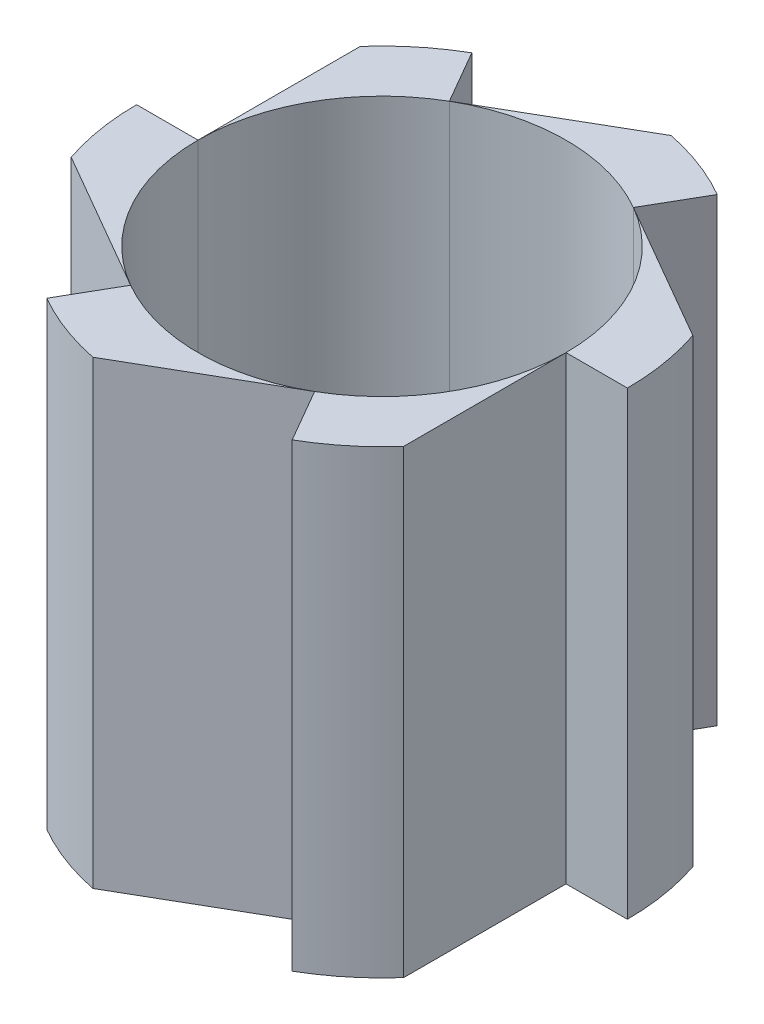
ISO-10303-21;
HEADER;
FILE_DESCRIPTION(('STEP AP214'),'2;1');
FILE_NAME('part.step','',(''),(''),'','','');
FILE_SCHEMA(('AUTOMOTIVE_DESIGN { 1 0 10303 214 1 1 1 1 }'));
ENDSEC;
DATA;
#1=APPLICATION_CONTEXT('core data for automotive mechanical design processes');
#2=APPLICATION_PROTOCOL_DEFINITION('international standard','automotive_design',2000,#1);
#3=PRODUCT_CONTEXT('',#1,'mechanical');
#4=PRODUCT('Part','Part','',(#3));
#5=PRODUCT_RELATED_PRODUCT_CATEGORY('part','',(#4));
#6=PRODUCT_DEFINITION_FORMATION('','',#4);
#7=PRODUCT_DEFINITION_CONTEXT('part definition',#1,'design');
#8=PRODUCT_DEFINITION('design','',#6,#7);
#9=PRODUCT_DEFINITION_SHAPE('','',#8);
#10=(LENGTH_UNIT() NAMED_UNIT(*) SI_UNIT(.MILLI.,.METRE.));
#11=(NAMED_UNIT(*) PLANE_ANGLE_UNIT() SI_UNIT($,.RADIAN.));
#12=(NAMED_UNIT(*) SI_UNIT($,.STERADIAN.) SOLID_ANGLE_UNIT());
#13=UNCERTAINTY_MEASURE_WITH_UNIT(LENGTH_MEASURE(1.E-05),#10,'distance_accuracy_value','');
#14=(GEOMETRIC_REPRESENTATION_CONTEXT(3) GLOBAL_UNCERTAINTY_ASSIGNED_CONTEXT((#13)) GLOBAL_UNIT_ASSIGNED_CONTEXT((#10,
#11,#12)) REPRESENTATION_CONTEXT('',''));
#15=CARTESIAN_POINT('',(0.,0.,0.));
#16=DIRECTION('',(0.,0.,1.));
#17=DIRECTION('',(1.,0.,0.));
#18=AXIS2_PLACEMENT_3D('',#15,#16,#17);
#19=CARTESIAN_POINT('',(0.,45.,0.));
#20=DIRECTION('',(0.,0.,1.));
#21=DIRECTION('',(1.,0.,0.));
#22=AXIS2_PLACEMENT_3D('',#19,#20,#21);
#23=PLANE('',#22);
#24=DIRECTION('',(-1.,0.,0.));
#25=VECTOR('',#24,1.);
#26=CARTESIAN_POINT('',(0.,0.,0.));
#27=LINE('',#26,#25);
#28=CARTESIAN_POINT('',(-18.,0.,0.));
#29=VERTEX_POINT('',#28);
#30=CARTESIAN_POINT('',(-24.,0.,0.));
#31=VERTEX_POINT('',#30);
#32=EDGE_CURVE('E206',#29,#31,#27,.T.);
#33=ORIENTED_EDGE('',*,*,#32,.T.);
#34=DIRECTION('',(0.,-1.,0.));
#35=VECTOR('',#34,1.);
#36=CARTESIAN_POINT('',(-24.,45.,0.));
#37=LINE('',#36,#35);
#38=CARTESIAN_POINT('',(-24.,45.,0.));
#39=VERTEX_POINT('',#38);
#40=EDGE_CURVE('E13',#39,#31,#37,.T.);
#41=ORIENTED_EDGE('',*,*,#40,.F.);
#42=DIRECTION('',(-1.,0.,0.));
#43=VECTOR('',#42,1.);
#44=CARTESIAN_POINT('',(0.,45.,0.));
#45=LINE('',#44,#43);
#46=CARTESIAN_POINT('',(-18.,45.,0.));
#47=VERTEX_POINT('',#46);
#48=EDGE_CURVE('E192',#47,#39,#45,.T.);
#49=ORIENTED_EDGE('',*,*,#48,.F.);
#50=DIRECTION('',(0.,-1.,0.));
#51=VECTOR('',#50,1.);
#52=CARTESIAN_POINT('',(-18.,45.,0.));
#53=LINE('',#52,#51);
#54=EDGE_CURVE('E159',#47,#29,#53,.T.);
#55=ORIENTED_EDGE('',*,*,#54,.T.);
#56=EDGE_LOOP('',(#33,#41,#49,#55));
#57=FACE_BOUND('',#56,.T.);
#58=ADVANCED_FACE('F143',(#57),#23,.F.);
#59=CARTESIAN_POINT('',(0.,45.,0.));
#60=DIRECTION('',(0.,-1.,0.));
#61=DIRECTION('',(0.,0.,-1.));
#62=AXIS2_PLACEMENT_3D('',#59,#60,#61);
#63=CYLINDRICAL_SURFACE('',#62,24.);
#64=CARTESIAN_POINT('',(0.,0.,0.));
#65=DIRECTION('',(0.,1.,0.));
#66=DIRECTION('',(0.,0.,1.));
#67=AXIS2_PLACEMENT_3D('',#64,#65,#66);
#68=CIRCLE('',#67,24.);
#69=CARTESIAN_POINT('',(-22.7477270848675,0.,7.65120333492611));
#70=VERTEX_POINT('',#69);
#71=EDGE_CURVE('E197',#31,#70,#68,.T.);
#72=ORIENTED_EDGE('',*,*,#71,.T.);
#73=DIRECTION('',(0.,-1.,0.));
#74=VECTOR('',#73,1.);
#75=CARTESIAN_POINT('',(-22.7477270848675,45.,7.65120333492611));
#76=LINE('',#75,#74);
#77=CARTESIAN_POINT('',(-22.7477270848675,45.,7.65120333492611));
#78=VERTEX_POINT('',#77);
#79=EDGE_CURVE('E151',#78,#70,#76,.T.);
#80=ORIENTED_EDGE('',*,*,#79,.F.);
#81=CARTESIAN_POINT('',(0.,45.,0.));
#82=DIRECTION('',(0.,1.,0.));
#83=DIRECTION('',(0.,0.,1.));
#84=AXIS2_PLACEMENT_3D('',#81,#82,#83);
#85=CIRCLE('',#84,24.);
#86=EDGE_CURVE('E184',#39,#78,#85,.T.);
#87=ORIENTED_EDGE('',*,*,#86,.F.);
#88=ORIENTED_EDGE('',*,*,#40,.T.);
#89=EDGE_LOOP('',(#72,#80,#87,#88));
#90=FACE_BOUND('',#89,.T.);
#91=ADVANCED_FACE('F196',(#90),#63,.T.);
#92=CARTESIAN_POINT('',(-9.,45.,15.5884572681199));
#93=DIRECTION('',(-0.5,0.,0.866025403784438));
#94=DIRECTION('',(0.866025403784439,0.,0.5));
#95=AXIS2_PLACEMENT_3D('',#92,#93,#94);
#96=PLANE('',#95);
#97=DIRECTION('',(-0.866025403784439,0.,-0.5));
#98=VECTOR('',#97,1.);
#99=CARTESIAN_POINT('',(-9.,0.,15.5884572681199));
#100=LINE('',#99,#98);
#101=CARTESIAN_POINT('',(-9.00000000000017,0.,15.5884572681199));
#102=VERTEX_POINT('',#101);
#103=EDGE_CURVE('E209',#102,#70,#100,.T.);
#104=ORIENTED_EDGE('',*,*,#103,.F.);
#105=DIRECTION('',(0.,-1.,0.));
#106=VECTOR('',#105,1.);
#107=CARTESIAN_POINT('',(-9.00000000000017,45.,15.5884572681199));
#108=LINE('',#107,#106);
#109=CARTESIAN_POINT('',(-9.00000000000017,45.,15.5884572681199));
#110=VERTEX_POINT('',#109);
#111=EDGE_CURVE('E173',#110,#102,#108,.T.);
#112=ORIENTED_EDGE('',*,*,#111,.F.);
#113=DIRECTION('',(-0.866025403784439,0.,-0.5));
#114=VECTOR('',#113,1.);
#115=CARTESIAN_POINT('',(-9.,45.,15.5884572681199));
#116=LINE('',#115,#114);
#117=EDGE_CURVE('E191',#110,#78,#116,.T.);
#118=ORIENTED_EDGE('',*,*,#117,.T.);
#119=ORIENTED_EDGE('',*,*,#79,.T.);
#120=EDGE_LOOP('',(#104,#112,#118,#119));
#121=FACE_BOUND('',#120,.T.);
#122=ADVANCED_FACE('F200',(#121),#96,.T.);
#123=CARTESIAN_POINT('',(0.,45.,0.));
#124=DIRECTION('',(0.,-1.,0.));
#125=DIRECTION('',(0.,0.,-1.));
#126=AXIS2_PLACEMENT_3D('',#123,#124,#125);
#127=CYLINDRICAL_SURFACE('',#126,18.);
#128=CARTESIAN_POINT('',(0.,0.,0.));
#129=DIRECTION('',(0.,1.,0.));
#130=DIRECTION('',(0.,0.,1.));
#131=AXIS2_PLACEMENT_3D('',#128,#129,#130);
#132=CIRCLE('',#131,18.);
#133=EDGE_CURVE('E211',#29,#102,#132,.T.);
#134=ORIENTED_EDGE('',*,*,#133,.F.);
#135=ORIENTED_EDGE('',*,*,#54,.F.);
#136=CARTESIAN_POINT('',(0.,45.,0.));
#137=DIRECTION('',(0.,1.,0.));
#138=DIRECTION('',(0.,0.,1.));
#139=AXIS2_PLACEMENT_3D('',#136,#137,#138);
#140=CIRCLE('',#139,18.);
#141=EDGE_CURVE('E201',#47,#110,#140,.T.);
#142=ORIENTED_EDGE('',*,*,#141,.T.);
#143=ORIENTED_EDGE('',*,*,#111,.T.);
#144=EDGE_LOOP('',(#134,#135,#142,#143));
#145=FACE_BOUND('',#144,.T.);
#146=ADVANCED_FACE('F217',(#145),#127,.F.);
#147=CARTESIAN_POINT('',(0.,45.,0.));
#148=DIRECTION('',(0.,1.,0.));
#149=DIRECTION('',(0.,0.,1.));
#150=AXIS2_PLACEMENT_3D('',#147,#148,#149);
#151=PLANE('',#150);
#152=ORIENTED_EDGE('',*,*,#48,.T.);
#153=ORIENTED_EDGE('',*,*,#86,.T.);
#154=ORIENTED_EDGE('',*,*,#117,.F.);
#155=ORIENTED_EDGE('',*,*,#141,.F.);
#156=EDGE_LOOP('',(#152,#153,#154,#155));
#157=FACE_BOUND('',#156,.T.);
#158=ADVANCED_FACE('F188',(#157),#151,.T.);
#159=CARTESIAN_POINT('',(0.,0.,0.));
#160=DIRECTION('',(0.,1.,0.));
#161=DIRECTION('',(0.,0.,1.));
#162=AXIS2_PLACEMENT_3D('',#159,#160,#161);
#163=PLANE('',#162);
#164=ORIENTED_EDGE('',*,*,#32,.F.);
#165=ORIENTED_EDGE('',*,*,#133,.T.);
#166=ORIENTED_EDGE('',*,*,#103,.T.);
#167=ORIENTED_EDGE('',*,*,#71,.F.);
#168=EDGE_LOOP('',(#164,#165,#166,#167));
#169=FACE_BOUND('',#168,.T.);
#170=ADVANCED_FACE('F216',(#169),#163,.F.);
#171=CLOSED_SHELL('',(#58,#91,#122,#146,#158,#170));
#172=MANIFOLD_SOLID_BREP('B2',#171);
#173=CARTESIAN_POINT('',(0.,45.,0.));
#174=DIRECTION('',(-0.866025403784435,0.,0.500000000000007));
#175=DIRECTION('',(0.500000000000007,0.,0.866025403784435));
#176=AXIS2_PLACEMENT_3D('',#173,#174,#175);
#177=PLANE('',#176);
#178=DIRECTION('',(-0.500000000000007,0.,-0.866025403784435));
#179=VECTOR('',#178,1.);
#180=CARTESIAN_POINT('',(0.,0.,0.));
#181=LINE('',#180,#179);
#182=CARTESIAN_POINT('',(-9.00000000000018,0.,-15.5884572681199));
#183=VERTEX_POINT('',#182);
#184=CARTESIAN_POINT('',(-12.0000000000002,0.,-20.7846096908265));
#185=VERTEX_POINT('',#184);
#186=EDGE_CURVE('E339',#183,#185,#181,.T.);
#187=ORIENTED_EDGE('',*,*,#186,.T.);
#188=DIRECTION('',(0.,-1.,0.));
#189=VECTOR('',#188,1.);
#190=CARTESIAN_POINT('',(-12.0000000000002,45.,-20.7846096908265));
#191=LINE('',#190,#189);
#192=CARTESIAN_POINT('',(-12.0000000000002,45.,-20.7846096908265));
#193=VERTEX_POINT('',#192);
#194=EDGE_CURVE('E141',#193,#185,#191,.T.);
#195=ORIENTED_EDGE('',*,*,#194,.F.);
#196=DIRECTION('',(-0.500000000000007,0.,-0.866025403784435));
#197=VECTOR('',#196,1.);
#198=CARTESIAN_POINT('',(0.,45.,0.));
#199=LINE('',#198,#197);
#200=CARTESIAN_POINT('',(-9.00000000000018,45.,-15.5884572681199));
#201=VERTEX_POINT('',#200);
#202=EDGE_CURVE('E325',#201,#193,#199,.T.);
#203=ORIENTED_EDGE('',*,*,#202,.F.);
#204=DIRECTION('',(0.,-1.,0.));
#205=VECTOR('',#204,1.);
#206=CARTESIAN_POINT('',(-9.00000000000018,45.,-15.5884572681199));
#207=LINE('',#206,#205);
#208=EDGE_CURVE('E292',#201,#183,#207,.T.);
#209=ORIENTED_EDGE('',*,*,#208,.T.);
#210=EDGE_LOOP('',(#187,#195,#203,#209));
#211=FACE_BOUND('',#210,.T.);
#212=ADVANCED_FACE('F276',(#211),#177,.F.);
#213=CARTESIAN_POINT('',(0.,45.,0.));
#214=DIRECTION('',(0.,-1.,0.));
#215=DIRECTION('',(0.,0.,-1.));
#216=AXIS2_PLACEMENT_3D('',#213,#214,#215);
#217=CYLINDRICAL_SURFACE('',#216,24.);
#218=CARTESIAN_POINT('',(0.,0.,0.));
#219=DIRECTION('',(0.,1.,0.));
#220=DIRECTION('',(0.,0.,1.));
#221=AXIS2_PLACEMENT_3D('',#218,#219,#220);
#222=CIRCLE('',#221,24.);
#223=CARTESIAN_POINT('',(-18.,0.,-15.8745078663875));
#224=VERTEX_POINT('',#223);
#225=EDGE_CURVE('E330',#185,#224,#222,.T.);
#226=ORIENTED_EDGE('',*,*,#225,.T.);
#227=DIRECTION('',(0.,-1.,0.));
#228=VECTOR('',#227,1.);
#229=CARTESIAN_POINT('',(-18.,45.,-15.8745078663875));
#230=LINE('',#229,#228);
#231=CARTESIAN_POINT('',(-18.,45.,-15.8745078663875));
#232=VERTEX_POINT('',#231);
#233=EDGE_CURVE('E284',#232,#224,#230,.T.);
#234=ORIENTED_EDGE('',*,*,#233,.F.);
#235=CARTESIAN_POINT('',(0.,45.,0.));
#236=DIRECTION('',(0.,1.,0.));
#237=DIRECTION('',(0.,0.,1.));
#238=AXIS2_PLACEMENT_3D('',#235,#236,#237);
#239=CIRCLE('',#238,24.);
#240=EDGE_CURVE('E317',#193,#232,#239,.T.);
#241=ORIENTED_EDGE('',*,*,#240,.F.);
#242=ORIENTED_EDGE('',*,*,#194,.T.);
#243=EDGE_LOOP('',(#226,#234,#241,#242));
#244=FACE_BOUND('',#243,.T.);
#245=ADVANCED_FACE('F329',(#244),#217,.T.);
#246=CARTESIAN_POINT('',(-18.,45.,0.));
#247=DIRECTION('',(-1.,0.,0.));
#248=DIRECTION('',(0.,0.,1.));
#249=AXIS2_PLACEMENT_3D('',#246,#247,#248);
#250=PLANE('',#249);
#251=DIRECTION('',(0.,0.,-1.));
#252=VECTOR('',#251,1.);
#253=CARTESIAN_POINT('',(-18.,0.,0.));
#254=LINE('',#253,#252);
#255=CARTESIAN_POINT('',(-18.,0.,0.));
#256=VERTEX_POINT('',#255);
#257=EDGE_CURVE('E342',#256,#224,#254,.T.);
#258=ORIENTED_EDGE('',*,*,#257,.F.);
#259=DIRECTION('',(0.,-1.,0.));
#260=VECTOR('',#259,1.);
#261=CARTESIAN_POINT('',(-18.,45.,0.));
#262=LINE('',#261,#260);
#263=CARTESIAN_POINT('',(-18.,45.,0.));
#264=VERTEX_POINT('',#263);
#265=EDGE_CURVE('E306',#264,#256,#262,.T.);
#266=ORIENTED_EDGE('',*,*,#265,.F.);
#267=DIRECTION('',(0.,0.,-1.));
#268=VECTOR('',#267,1.);
#269=CARTESIAN_POINT('',(-18.,45.,0.));
#270=LINE('',#269,#268);
#271=EDGE_CURVE('E324',#264,#232,#270,.T.);
#272=ORIENTED_EDGE('',*,*,#271,.T.);
#273=ORIENTED_EDGE('',*,*,#233,.T.);
#274=EDGE_LOOP('',(#258,#266,#272,#273));
#275=FACE_BOUND('',#274,.T.);
#276=ADVANCED_FACE('F333',(#275),#250,.T.);
#277=CARTESIAN_POINT('',(0.,45.,0.));
#278=DIRECTION('',(0.,-1.,0.));
#279=DIRECTION('',(0.,0.,-1.));
#280=AXIS2_PLACEMENT_3D('',#277,#278,#279);
#281=CYLINDRICAL_SURFACE('',#280,18.);
#282=CARTESIAN_POINT('',(0.,0.,0.));
#283=DIRECTION('',(0.,1.,0.));
#284=DIRECTION('',(0.,0.,1.));
#285=AXIS2_PLACEMENT_3D('',#282,#283,#284);
#286=CIRCLE('',#285,18.);
#287=EDGE_CURVE('E344',#183,#256,#286,.T.);
#288=ORIENTED_EDGE('',*,*,#287,.F.);
#289=ORIENTED_EDGE('',*,*,#208,.F.);
#290=CARTESIAN_POINT('',(0.,45.,0.));
#291=DIRECTION('',(0.,1.,0.));
#292=DIRECTION('',(0.,0.,1.));
#293=AXIS2_PLACEMENT_3D('',#290,#291,#292);
#294=CIRCLE('',#293,18.);
#295=EDGE_CURVE('E334',#201,#264,#294,.T.);
#296=ORIENTED_EDGE('',*,*,#295,.T.);
#297=ORIENTED_EDGE('',*,*,#265,.T.);
#298=EDGE_LOOP('',(#288,#289,#296,#297));
#299=FACE_BOUND('',#298,.T.);
#300=ADVANCED_FACE('F350',(#299),#281,.F.);
#301=CARTESIAN_POINT('',(0.,45.,0.));
#302=DIRECTION('',(0.,1.,0.));
#303=DIRECTION('',(0.,0.,1.));
#304=AXIS2_PLACEMENT_3D('',#301,#302,#303);
#305=PLANE('',#304);
#306=ORIENTED_EDGE('',*,*,#202,.T.);
#307=ORIENTED_EDGE('',*,*,#240,.T.);
#308=ORIENTED_EDGE('',*,*,#271,.F.);
#309=ORIENTED_EDGE('',*,*,#295,.F.);
#310=EDGE_LOOP('',(#306,#307,#308,#309));
#311=FACE_BOUND('',#310,.T.);
#312=ADVANCED_FACE('F321',(#311),#305,.T.);
#313=CARTESIAN_POINT('',(0.,0.,0.));
#314=DIRECTION('',(0.,1.,0.));
#315=DIRECTION('',(0.,0.,1.));
#316=AXIS2_PLACEMENT_3D('',#313,#314,#315);
#317=PLANE('',#316);
#318=ORIENTED_EDGE('',*,*,#186,.F.);
#319=ORIENTED_EDGE('',*,*,#287,.T.);
#320=ORIENTED_EDGE('',*,*,#257,.T.);
#321=ORIENTED_EDGE('',*,*,#225,.F.);
#322=EDGE_LOOP('',(#318,#319,#320,#321));
#323=FACE_BOUND('',#322,.T.);
#324=ADVANCED_FACE('F349',(#323),#317,.F.);
#325=CLOSED_SHELL('',(#212,#245,#276,#300,#312,#324));
#326=MANIFOLD_SOLID_BREP('B7',#325);
#327=CARTESIAN_POINT('',(0.,45.,0.));
#328=DIRECTION('',(-0.866025403784435,0.,-0.500000000000007));
#329=DIRECTION('',(-0.500000000000007,0.,0.866025403784435));
#330=AXIS2_PLACEMENT_3D('',#327,#328,#329);
#331=PLANE('',#330);
#332=DIRECTION('',(0.500000000000007,0.,-0.866025403784435));
#333=VECTOR('',#332,1.);
#334=CARTESIAN_POINT('',(0.,0.,0.));
#335=LINE('',#334,#333);
#336=CARTESIAN_POINT('',(9.00000000000018,0.,-15.5884572681199));
#337=VERTEX_POINT('',#336);
#338=CARTESIAN_POINT('',(12.0000000000002,0.,-20.7846096908265));
#339=VERTEX_POINT('',#338);
#340=EDGE_CURVE('E472',#337,#339,#335,.T.);
#341=ORIENTED_EDGE('',*,*,#340,.T.);
#342=DIRECTION('',(0.,-1.,0.));
#343=VECTOR('',#342,1.);
#344=CARTESIAN_POINT('',(12.0000000000002,45.,-20.7846096908265));
#345=LINE('',#344,#343);
#346=CARTESIAN_POINT('',(12.0000000000002,45.,-20.7846096908265));
#347=VERTEX_POINT('',#346);
#348=EDGE_CURVE('E274',#347,#339,#345,.T.);
#349=ORIENTED_EDGE('',*,*,#348,.F.);
#350=DIRECTION('',(0.500000000000007,0.,-0.866025403784435));
#351=VECTOR('',#350,1.);
#352=CARTESIAN_POINT('',(0.,45.,0.));
#353=LINE('',#352,#351);
#354=CARTESIAN_POINT('',(9.00000000000018,45.,-15.5884572681199));
#355=VERTEX_POINT('',#354);
#356=EDGE_CURVE('E458',#355,#347,#353,.T.);
#357=ORIENTED_EDGE('',*,*,#356,.F.);
#358=DIRECTION('',(0.,-1.,0.));
#359=VECTOR('',#358,1.);
#360=CARTESIAN_POINT('',(9.00000000000018,45.,-15.5884572681199));
#361=LINE('',#360,#359);
#362=EDGE_CURVE('E425',#355,#337,#361,.T.);
#363=ORIENTED_EDGE('',*,*,#362,.T.);
#364=EDGE_LOOP('',(#341,#349,#357,#363));
#365=FACE_BOUND('',#364,.T.);
#366=ADVANCED_FACE('F409',(#365),#331,.F.);
#367=CARTESIAN_POINT('',(0.,45.,0.));
#368=DIRECTION('',(0.,-1.,0.));
#369=DIRECTION('',(0.,0.,-1.));
#370=AXIS2_PLACEMENT_3D('',#367,#368,#369);
#371=CYLINDRICAL_SURFACE('',#370,24.);
#372=CARTESIAN_POINT('',(0.,0.,0.));
#373=DIRECTION('',(0.,1.,0.));
#374=DIRECTION('',(0.,0.,1.));
#375=AXIS2_PLACEMENT_3D('',#372,#373,#374);
#376=CIRCLE('',#375,24.);
#377=CARTESIAN_POINT('',(4.74772708486752,0.,-23.5257112013137));
#378=VERTEX_POINT('',#377);
#379=EDGE_CURVE('E463',#339,#378,#376,.T.);
#380=ORIENTED_EDGE('',*,*,#379,.T.);
#381=DIRECTION('',(0.,-1.,0.));
#382=VECTOR('',#381,1.);
#383=CARTESIAN_POINT('',(4.74772708486752,45.,-23.5257112013137));
#384=LINE('',#383,#382);
#385=CARTESIAN_POINT('',(4.74772708486752,45.,-23.5257112013137));
#386=VERTEX_POINT('',#385);
#387=EDGE_CURVE('E417',#386,#378,#384,.T.);
#388=ORIENTED_EDGE('',*,*,#387,.F.);
#389=CARTESIAN_POINT('',(0.,45.,0.));
#390=DIRECTION('',(0.,1.,0.));
#391=DIRECTION('',(0.,0.,1.));
#392=AXIS2_PLACEMENT_3D('',#389,#390,#391);
#393=CIRCLE('',#392,24.);
#394=EDGE_CURVE('E450',#347,#386,#393,.T.);
#395=ORIENTED_EDGE('',*,*,#394,.F.);
#396=ORIENTED_EDGE('',*,*,#348,.T.);
#397=EDGE_LOOP('',(#380,#388,#395,#396));
#398=FACE_BOUND('',#397,.T.);
#399=ADVANCED_FACE('F462',(#398),#371,.T.);
#400=CARTESIAN_POINT('',(-9.,45.,-15.5884572681199));
#401=DIRECTION('',(-0.5,0.,-0.866025403784439));
#402=DIRECTION('',(-0.866025403784439,0.,0.5));
#403=AXIS2_PLACEMENT_3D('',#400,#401,#402);
#404=PLANE('',#403);
#405=DIRECTION('',(0.866025403784439,0.,-0.5));
#406=VECTOR('',#405,1.);
#407=CARTESIAN_POINT('',(-9.,0.,-15.5884572681199));
#408=LINE('',#407,#406);
#409=CARTESIAN_POINT('',(-9.00000000000018,0.,-15.5884572681199));
#410=VERTEX_POINT('',#409);
#411=EDGE_CURVE('E475',#410,#378,#408,.T.);
#412=ORIENTED_EDGE('',*,*,#411,.F.);
#413=DIRECTION('',(0.,-1.,0.));
#414=VECTOR('',#413,1.);
#415=CARTESIAN_POINT('',(-9.00000000000018,45.,-15.5884572681199));
#416=LINE('',#415,#414);
#417=CARTESIAN_POINT('',(-9.00000000000018,45.,-15.5884572681199));
#418=VERTEX_POINT('',#417);
#419=EDGE_CURVE('E439',#418,#410,#416,.T.);
#420=ORIENTED_EDGE('',*,*,#419,.F.);
#421=DIRECTION('',(0.866025403784439,0.,-0.5));
#422=VECTOR('',#421,1.);
#423=CARTESIAN_POINT('',(-9.,45.,-15.5884572681199));
#424=LINE('',#423,#422);
#425=EDGE_CURVE('E457',#418,#386,#424,.T.);
#426=ORIENTED_EDGE('',*,*,#425,.T.);
#427=ORIENTED_EDGE('',*,*,#387,.T.);
#428=EDGE_LOOP('',(#412,#420,#426,#427));
#429=FACE_BOUND('',#428,.T.);
#430=ADVANCED_FACE('F466',(#429),#404,.T.);
#431=CARTESIAN_POINT('',(0.,45.,0.));
#432=DIRECTION('',(0.,-1.,0.));
#433=DIRECTION('',(0.,0.,-1.));
#434=AXIS2_PLACEMENT_3D('',#431,#432,#433);
#435=CYLINDRICAL_SURFACE('',#434,18.);
#436=CARTESIAN_POINT('',(0.,0.,0.));
#437=DIRECTION('',(0.,1.,0.));
#438=DIRECTION('',(0.,0.,1.));
#439=AXIS2_PLACEMENT_3D('',#436,#437,#438);
#440=CIRCLE('',#439,18.);
#441=EDGE_CURVE('E477',#337,#410,#440,.T.);
#442=ORIENTED_EDGE('',*,*,#441,.F.);
#443=ORIENTED_EDGE('',*,*,#362,.F.);
#444=CARTESIAN_POINT('',(0.,45.,0.));
#445=DIRECTION('',(0.,1.,0.));
#446=DIRECTION('',(0.,0.,1.));
#447=AXIS2_PLACEMENT_3D('',#444,#445,#446);
#448=CIRCLE('',#447,18.);
#449=EDGE_CURVE('E467',#355,#418,#448,.T.);
#450=ORIENTED_EDGE('',*,*,#449,.T.);
#451=ORIENTED_EDGE('',*,*,#419,.T.);
#452=EDGE_LOOP('',(#442,#443,#450,#451));
#453=FACE_BOUND('',#452,.T.);
#454=ADVANCED_FACE('F483',(#453),#435,.F.);
#455=CARTESIAN_POINT('',(0.,45.,0.));
#456=DIRECTION('',(0.,1.,0.));
#457=DIRECTION('',(0.,0.,1.));
#458=AXIS2_PLACEMENT_3D('',#455,#456,#457);
#459=PLANE('',#458);
#460=ORIENTED_EDGE('',*,*,#356,.T.);
#461=ORIENTED_EDGE('',*,*,#394,.T.);
#462=ORIENTED_EDGE('',*,*,#425,.F.);
#463=ORIENTED_EDGE('',*,*,#449,.F.);
#464=EDGE_LOOP('',(#460,#461,#462,#463));
#465=FACE_BOUND('',#464,.T.);
#466=ADVANCED_FACE('F454',(#465),#459,.T.);
#467=CARTESIAN_POINT('',(0.,0.,0.));
#468=DIRECTION('',(0.,1.,0.));
#469=DIRECTION('',(0.,0.,1.));
#470=AXIS2_PLACEMENT_3D('',#467,#468,#469);
#471=PLANE('',#470);
#472=ORIENTED_EDGE('',*,*,#340,.F.);
#473=ORIENTED_EDGE('',*,*,#441,.T.);
#474=ORIENTED_EDGE('',*,*,#411,.T.);
#475=ORIENTED_EDGE('',*,*,#379,.F.);
#476=EDGE_LOOP('',(#472,#473,#474,#475));
#477=FACE_BOUND('',#476,.T.);
#478=ADVANCED_FACE('F482',(#477),#471,.F.);
#479=CLOSED_SHELL('',(#366,#399,#430,#454,#466,#478));
#480=MANIFOLD_SOLID_BREP('B135',#479);
#481=CARTESIAN_POINT('',(0.,45.,0.));
#482=DIRECTION('',(0.,0.,-1.));
#483=DIRECTION('',(-1.,0.,0.));
#484=AXIS2_PLACEMENT_3D('',#481,#482,#483);
#485=PLANE('',#484);
#486=DIRECTION('',(1.,0.,0.));
#487=VECTOR('',#486,1.);
#488=CARTESIAN_POINT('',(0.,0.,0.));
#489=LINE('',#488,#487);
#490=CARTESIAN_POINT('',(18.,0.,0.));
#491=VERTEX_POINT('',#490);
#492=CARTESIAN_POINT('',(24.,0.,0.));
#493=VERTEX_POINT('',#492);
#494=EDGE_CURVE('E605',#491,#493,#489,.T.);
#495=ORIENTED_EDGE('',*,*,#494,.T.);
#496=DIRECTION('',(0.,-1.,0.));
#497=VECTOR('',#496,1.);
#498=CARTESIAN_POINT('',(24.,45.,0.));
#499=LINE('',#498,#497);
#500=CARTESIAN_POINT('',(24.,45.,0.));
#501=VERTEX_POINT('',#500);
#502=EDGE_CURVE('E407',#501,#493,#499,.T.);
#503=ORIENTED_EDGE('',*,*,#502,.F.);
#504=DIRECTION('',(1.,0.,0.));
#505=VECTOR('',#504,1.);
#506=CARTESIAN_POINT('',(0.,45.,0.));
#507=LINE('',#506,#505);
#508=CARTESIAN_POINT('',(18.,45.,0.));
#509=VERTEX_POINT('',#508);
#510=EDGE_CURVE('E591',#509,#501,#507,.T.);
#511=ORIENTED_EDGE('',*,*,#510,.F.);
#512=DIRECTION('',(0.,-1.,0.));
#513=VECTOR('',#512,1.);
#514=CARTESIAN_POINT('',(18.,45.,0.));
#515=LINE('',#514,#513);
#516=EDGE_CURVE('E558',#509,#491,#515,.T.);
#517=ORIENTED_EDGE('',*,*,#516,.T.);
#518=EDGE_LOOP('',(#495,#503,#511,#517));
#519=FACE_BOUND('',#518,.T.);
#520=ADVANCED_FACE('F542',(#519),#485,.F.);
#521=CARTESIAN_POINT('',(0.,45.,0.));
#522=DIRECTION('',(0.,-1.,0.));
#523=DIRECTION('',(0.,0.,-1.));
#524=AXIS2_PLACEMENT_3D('',#521,#522,#523);
#525=CYLINDRICAL_SURFACE('',#524,24.);
#526=CARTESIAN_POINT('',(0.,0.,0.));
#527=DIRECTION('',(0.,1.,0.));
#528=DIRECTION('',(0.,0.,1.));
#529=AXIS2_PLACEMENT_3D('',#526,#527,#528);
#530=CIRCLE('',#529,24.);
#531=CARTESIAN_POINT('',(22.7477270848675,0.,-7.65120333492612));
#532=VERTEX_POINT('',#531);
#533=EDGE_CURVE('E596',#493,#532,#530,.T.);
#534=ORIENTED_EDGE('',*,*,#533,.T.);
#535=DIRECTION('',(0.,-1.,0.));
#536=VECTOR('',#535,1.);
#537=CARTESIAN_POINT('',(22.7477270848675,45.,-7.65120333492612));
#538=LINE('',#537,#536);
#539=CARTESIAN_POINT('',(22.7477270848675,45.,-7.65120333492612));
#540=VERTEX_POINT('',#539);
#541=EDGE_CURVE('E550',#540,#532,#538,.T.);
#542=ORIENTED_EDGE('',*,*,#541,.F.);
#543=CARTESIAN_POINT('',(0.,45.,0.));
#544=DIRECTION('',(0.,1.,0.));
#545=DIRECTION('',(0.,0.,1.));
#546=AXIS2_PLACEMENT_3D('',#543,#544,#545);
#547=CIRCLE('',#546,24.);
#548=EDGE_CURVE('E583',#501,#540,#547,.T.);
#549=ORIENTED_EDGE('',*,*,#548,.F.);
#550=ORIENTED_EDGE('',*,*,#502,.T.);
#551=EDGE_LOOP('',(#534,#542,#549,#550));
#552=FACE_BOUND('',#551,.T.);
#553=ADVANCED_FACE('F595',(#552),#525,.T.);
#554=CARTESIAN_POINT('',(9.00000000000001,45.,-15.5884572681199));
#555=DIRECTION('',(0.5,0.,-0.866025403784438));
#556=DIRECTION('',(-0.866025403784438,0.,-0.5));
#557=AXIS2_PLACEMENT_3D('',#554,#555,#556);
#558=PLANE('',#557);
#559=DIRECTION('',(0.866025403784438,0.,0.500000000000001));
#560=VECTOR('',#559,1.);
#561=CARTESIAN_POINT('',(9.00000000000001,0.,-15.5884572681199));
#562=LINE('',#561,#560);
#563=CARTESIAN_POINT('',(9.00000000000018,0.,-15.5884572681199));
#564=VERTEX_POINT('',#563);
#565=EDGE_CURVE('E608',#564,#532,#562,.T.);
#566=ORIENTED_EDGE('',*,*,#565,.F.);
#567=DIRECTION('',(0.,-1.,0.));
#568=VECTOR('',#567,1.);
#569=CARTESIAN_POINT('',(9.00000000000018,45.,-15.5884572681199));
#570=LINE('',#569,#568);
#571=CARTESIAN_POINT('',(9.00000000000018,45.,-15.5884572681199));
#572=VERTEX_POINT('',#571);
#573=EDGE_CURVE('E572',#572,#564,#570,.T.);
#574=ORIENTED_EDGE('',*,*,#573,.F.);
#575=DIRECTION('',(0.866025403784438,0.,0.500000000000001));
#576=VECTOR('',#575,1.);
#577=CARTESIAN_POINT('',(9.00000000000001,45.,-15.5884572681199));
#578=LINE('',#577,#576);
#579=EDGE_CURVE('E590',#572,#540,#578,.T.);
#580=ORIENTED_EDGE('',*,*,#579,.T.);
#581=ORIENTED_EDGE('',*,*,#541,.T.);
#582=EDGE_LOOP('',(#566,#574,#580,#581));
#583=FACE_BOUND('',#582,.T.);
#584=ADVANCED_FACE('F599',(#583),#558,.T.);
#585=CARTESIAN_POINT('',(0.,45.,0.));
#586=DIRECTION('',(0.,-1.,0.));
#587=DIRECTION('',(0.,0.,-1.));
#588=AXIS2_PLACEMENT_3D('',#585,#586,#587);
#589=CYLINDRICAL_SURFACE('',#588,18.);
#590=CARTESIAN_POINT('',(0.,0.,0.));
#591=DIRECTION('',(0.,1.,0.));
#592=DIRECTION('',(0.,0.,1.));
#593=AXIS2_PLACEMENT_3D('',#590,#591,#592);
#594=CIRCLE('',#593,18.);
#595=EDGE_CURVE('E610',#491,#564,#594,.T.);
#596=ORIENTED_EDGE('',*,*,#595,.F.);
#597=ORIENTED_EDGE('',*,*,#516,.F.);
#598=CARTESIAN_POINT('',(0.,45.,0.));
#599=DIRECTION('',(0.,1.,0.));
#600=DIRECTION('',(0.,0.,1.));
#601=AXIS2_PLACEMENT_3D('',#598,#599,#600);
#602=CIRCLE('',#601,18.);
#603=EDGE_CURVE('E600',#509,#572,#602,.T.);
#604=ORIENTED_EDGE('',*,*,#603,.T.);
#605=ORIENTED_EDGE('',*,*,#573,.T.);
#606=EDGE_LOOP('',(#596,#597,#604,#605));
#607=FACE_BOUND('',#606,.T.);
#608=ADVANCED_FACE('F616',(#607),#589,.F.);
#609=CARTESIAN_POINT('',(0.,45.,0.));
#610=DIRECTION('',(0.,1.,0.));
#611=DIRECTION('',(0.,0.,1.));
#612=AXIS2_PLACEMENT_3D('',#609,#610,#611);
#613=PLANE('',#612);
#614=ORIENTED_EDGE('',*,*,#510,.T.);
#615=ORIENTED_EDGE('',*,*,#548,.T.);
#616=ORIENTED_EDGE('',*,*,#579,.F.);
#617=ORIENTED_EDGE('',*,*,#603,.F.);
#618=EDGE_LOOP('',(#614,#615,#616,#617));
#619=FACE_BOUND('',#618,.T.);
#620=ADVANCED_FACE('F587',(#619),#613,.T.);
#621=CARTESIAN_POINT('',(0.,0.,0.));
#622=DIRECTION('',(0.,1.,0.));
#623=DIRECTION('',(0.,0.,1.));
#624=AXIS2_PLACEMENT_3D('',#621,#622,#623);
#625=PLANE('',#624);
#626=ORIENTED_EDGE('',*,*,#494,.F.);
#627=ORIENTED_EDGE('',*,*,#595,.T.);
#628=ORIENTED_EDGE('',*,*,#565,.T.);
#629=ORIENTED_EDGE('',*,*,#533,.F.);
#630=EDGE_LOOP('',(#626,#627,#628,#629));
#631=FACE_BOUND('',#630,.T.);
#632=ADVANCED_FACE('F615',(#631),#625,.F.);
#633=CLOSED_SHELL('',(#520,#553,#584,#608,#620,#632));
#634=MANIFOLD_SOLID_BREP('B268',#633);
#635=CARTESIAN_POINT('',(0.,45.,0.));
#636=DIRECTION('',(0.866025403784434,0.,-0.500000000000007));
#637=DIRECTION('',(-0.500000000000007,0.,-0.866025403784434));
#638=AXIS2_PLACEMENT_3D('',#635,#636,#637);
#639=PLANE('',#638);
#640=DIRECTION('',(0.500000000000007,0.,0.866025403784434));
#641=VECTOR('',#640,1.);
#642=CARTESIAN_POINT('',(0.,0.,0.));
#643=LINE('',#642,#641);
#644=CARTESIAN_POINT('',(9.00000000000019,0.,15.5884572681199));
#645=VERTEX_POINT('',#644);
#646=CARTESIAN_POINT('',(12.0000000000002,0.,20.7846096908265));
#647=VERTEX_POINT('',#646);
#648=EDGE_CURVE('E737',#645,#647,#643,.T.);
#649=ORIENTED_EDGE('',*,*,#648,.T.);
#650=DIRECTION('',(0.,-1.,0.));
#651=VECTOR('',#650,1.);
#652=CARTESIAN_POINT('',(12.0000000000002,45.,20.7846096908265));
#653=LINE('',#652,#651);
#654=CARTESIAN_POINT('',(12.0000000000002,45.,20.7846096908265));
#655=VERTEX_POINT('',#654);
#656=EDGE_CURVE('E540',#655,#647,#653,.T.);
#657=ORIENTED_EDGE('',*,*,#656,.F.);
#658=DIRECTION('',(0.500000000000007,0.,0.866025403784434));
#659=VECTOR('',#658,1.);
#660=CARTESIAN_POINT('',(0.,45.,0.));
#661=LINE('',#660,#659);
#662=CARTESIAN_POINT('',(9.00000000000019,45.,15.5884572681199));
#663=VERTEX_POINT('',#662);
#664=EDGE_CURVE('E723',#663,#655,#661,.T.);
#665=ORIENTED_EDGE('',*,*,#664,.F.);
#666=DIRECTION('',(0.,-1.,0.));
#667=VECTOR('',#666,1.);
#668=CARTESIAN_POINT('',(9.00000000000019,45.,15.5884572681199));
#669=LINE('',#668,#667);
#670=EDGE_CURVE('E690',#663,#645,#669,.T.);
#671=ORIENTED_EDGE('',*,*,#670,.T.);
#672=EDGE_LOOP('',(#649,#657,#665,#671));
#673=FACE_BOUND('',#672,.T.);
#674=ADVANCED_FACE('F674',(#673),#639,.F.);
#675=CARTESIAN_POINT('',(0.,45.,0.));
#676=DIRECTION('',(0.,-1.,0.));
#677=DIRECTION('',(0.,0.,-1.));
#678=AXIS2_PLACEMENT_3D('',#675,#676,#677);
#679=CYLINDRICAL_SURFACE('',#678,24.);
#680=CARTESIAN_POINT('',(0.,0.,0.));
#681=DIRECTION('',(0.,1.,0.));
#682=DIRECTION('',(0.,0.,1.));
#683=AXIS2_PLACEMENT_3D('',#680,#681,#682);
#684=CIRCLE('',#683,24.);
#685=CARTESIAN_POINT('',(18.,0.,15.8745078663875));
#686=VERTEX_POINT('',#685);
#687=EDGE_CURVE('E728',#647,#686,#684,.T.);
#688=ORIENTED_EDGE('',*,*,#687,.T.);
#689=DIRECTION('',(0.,-1.,0.));
#690=VECTOR('',#689,1.);
#691=CARTESIAN_POINT('',(18.,45.,15.8745078663875));
#692=LINE('',#691,#690);
#693=CARTESIAN_POINT('',(18.,45.,15.8745078663875));
#694=VERTEX_POINT('',#693);
#695=EDGE_CURVE('E682',#694,#686,#692,.T.);
#696=ORIENTED_EDGE('',*,*,#695,.F.);
#697=CARTESIAN_POINT('',(0.,45.,0.));
#698=DIRECTION('',(0.,1.,0.));
#699=DIRECTION('',(0.,0.,1.));
#700=AXIS2_PLACEMENT_3D('',#697,#698,#699);
#701=CIRCLE('',#700,24.);
#702=EDGE_CURVE('E715',#655,#694,#701,.T.);
#703=ORIENTED_EDGE('',*,*,#702,.F.);
#704=ORIENTED_EDGE('',*,*,#656,.T.);
#705=EDGE_LOOP('',(#688,#696,#703,#704));
#706=FACE_BOUND('',#705,.T.);
#707=ADVANCED_FACE('F727',(#706),#679,.T.);
#708=CARTESIAN_POINT('',(18.,45.,0.));
#709=DIRECTION('',(1.,0.,0.));
#710=DIRECTION('',(0.,0.,-1.));
#711=AXIS2_PLACEMENT_3D('',#708,#709,#710);
#712=PLANE('',#711);
#713=DIRECTION('',(0.,0.,1.));
#714=VECTOR('',#713,1.);
#715=CARTESIAN_POINT('',(18.,0.,0.));
#716=LINE('',#715,#714);
#717=CARTESIAN_POINT('',(18.,0.,0.));
#718=VERTEX_POINT('',#717);
#719=EDGE_CURVE('E740',#718,#686,#716,.T.);
#720=ORIENTED_EDGE('',*,*,#719,.F.);
#721=DIRECTION('',(0.,-1.,0.));
#722=VECTOR('',#721,1.);
#723=CARTESIAN_POINT('',(18.,45.,0.));
#724=LINE('',#723,#722);
#725=CARTESIAN_POINT('',(18.,45.,0.));
#726=VERTEX_POINT('',#725);
#727=EDGE_CURVE('E704',#726,#718,#724,.T.);
#728=ORIENTED_EDGE('',*,*,#727,.F.);
#729=DIRECTION('',(0.,0.,1.));
#730=VECTOR('',#729,1.);
#731=CARTESIAN_POINT('',(18.,45.,0.));
#732=LINE('',#731,#730);
#733=EDGE_CURVE('E722',#726,#694,#732,.T.);
#734=ORIENTED_EDGE('',*,*,#733,.T.);
#735=ORIENTED_EDGE('',*,*,#695,.T.);
#736=EDGE_LOOP('',(#720,#728,#734,#735));
#737=FACE_BOUND('',#736,.T.);
#738=ADVANCED_FACE('F731',(#737),#712,.T.);
#739=CARTESIAN_POINT('',(0.,45.,0.));
#740=DIRECTION('',(0.,-1.,0.));
#741=DIRECTION('',(0.,0.,-1.));
#742=AXIS2_PLACEMENT_3D('',#739,#740,#741);
#743=CYLINDRICAL_SURFACE('',#742,18.);
#744=CARTESIAN_POINT('',(0.,0.,0.));
#745=DIRECTION('',(0.,1.,0.));
#746=DIRECTION('',(0.,0.,1.));
#747=AXIS2_PLACEMENT_3D('',#744,#745,#746);
#748=CIRCLE('',#747,18.);
#749=EDGE_CURVE('E742',#645,#718,#748,.T.);
#750=ORIENTED_EDGE('',*,*,#749,.F.);
#751=ORIENTED_EDGE('',*,*,#670,.F.);
#752=CARTESIAN_POINT('',(0.,45.,0.));
#753=DIRECTION('',(0.,1.,0.));
#754=DIRECTION('',(0.,0.,1.));
#755=AXIS2_PLACEMENT_3D('',#752,#753,#754);
#756=CIRCLE('',#755,18.);
#757=EDGE_CURVE('E732',#663,#726,#756,.T.);
#758=ORIENTED_EDGE('',*,*,#757,.T.);
#759=ORIENTED_EDGE('',*,*,#727,.T.);
#760=EDGE_LOOP('',(#750,#751,#758,#759));
#761=FACE_BOUND('',#760,.T.);
#762=ADVANCED_FACE('F748',(#761),#743,.F.);
#763=CARTESIAN_POINT('',(0.,45.,0.));
#764=DIRECTION('',(0.,1.,0.));
#765=DIRECTION('',(0.,0.,1.));
#766=AXIS2_PLACEMENT_3D('',#763,#764,#765);
#767=PLANE('',#766);
#768=ORIENTED_EDGE('',*,*,#664,.T.);
#769=ORIENTED_EDGE('',*,*,#702,.T.);
#770=ORIENTED_EDGE('',*,*,#733,.F.);
#771=ORIENTED_EDGE('',*,*,#757,.F.);
#772=EDGE_LOOP('',(#768,#769,#770,#771));
#773=FACE_BOUND('',#772,.T.);
#774=ADVANCED_FACE('F719',(#773),#767,.T.);
#775=CARTESIAN_POINT('',(0.,0.,0.));
#776=DIRECTION('',(0.,1.,0.));
#777=DIRECTION('',(0.,0.,1.));
#778=AXIS2_PLACEMENT_3D('',#775,#776,#777);
#779=PLANE('',#778);
#780=ORIENTED_EDGE('',*,*,#648,.F.);
#781=ORIENTED_EDGE('',*,*,#749,.T.);
#782=ORIENTED_EDGE('',*,*,#719,.T.);
#783=ORIENTED_EDGE('',*,*,#687,.F.);
#784=EDGE_LOOP('',(#780,#781,#782,#783));
#785=FACE_BOUND('',#784,.T.);
#786=ADVANCED_FACE('F747',(#785),#779,.F.);
#787=CLOSED_SHELL('',(#674,#707,#738,#762,#774,#786));
#788=MANIFOLD_SOLID_BREP('B401',#787);
#789=CARTESIAN_POINT('',(0.,45.,0.));
#790=DIRECTION('',(0.866025403784435,0.,0.500000000000006));
#791=DIRECTION('',(0.500000000000007,0.,-0.866025403784435));
#792=AXIS2_PLACEMENT_3D('',#789,#790,#791);
#793=PLANE('',#792);
#794=DIRECTION('',(-0.500000000000007,0.,0.866025403784435));
#795=VECTOR('',#794,1.);
#796=CARTESIAN_POINT('',(0.,0.,0.));
#797=LINE('',#796,#795);
#798=CARTESIAN_POINT('',(-9.00000000000017,0.,15.5884572681199));
#799=VERTEX_POINT('',#798);
#800=CARTESIAN_POINT('',(-12.0000000000002,0.,20.7846096908265));
#801=VERTEX_POINT('',#800);
#802=EDGE_CURVE('E860',#799,#801,#797,.T.);
#803=ORIENTED_EDGE('',*,*,#802,.T.);
#804=DIRECTION('',(0.,-1.,0.));
#805=VECTOR('',#804,1.);
#806=CARTESIAN_POINT('',(-12.0000000000002,45.,20.7846096908265));
#807=LINE('',#806,#805);
#808=CARTESIAN_POINT('',(-12.0000000000002,45.,20.7846096908265));
#809=VERTEX_POINT('',#808);
#810=EDGE_CURVE('E672',#809,#801,#807,.T.);
#811=ORIENTED_EDGE('',*,*,#810,.F.);
#812=DIRECTION('',(-0.500000000000007,0.,0.866025403784435));
#813=VECTOR('',#812,1.);
#814=CARTESIAN_POINT('',(0.,45.,0.));
#815=LINE('',#814,#813);
#816=CARTESIAN_POINT('',(-9.00000000000017,45.,15.5884572681199));
#817=VERTEX_POINT('',#816);
#818=EDGE_CURVE('E846',#817,#809,#815,.T.);
#819=ORIENTED_EDGE('',*,*,#818,.F.);
#820=DIRECTION('',(0.,-1.,0.));
#821=VECTOR('',#820,1.);
#822=CARTESIAN_POINT('',(-9.00000000000017,45.,15.5884572681199));
#823=LINE('',#822,#821);
#824=EDGE_CURVE('E813',#817,#799,#823,.T.);
#825=ORIENTED_EDGE('',*,*,#824,.T.);
#826=EDGE_LOOP('',(#803,#811,#819,#825));
#827=FACE_BOUND('',#826,.T.);
#828=ADVANCED_FACE('F797',(#827),#793,.F.);
#829=CARTESIAN_POINT('',(0.,45.,0.));
#830=DIRECTION('',(0.,-1.,0.));
#831=DIRECTION('',(0.,0.,-1.));
#832=AXIS2_PLACEMENT_3D('',#829,#830,#831);
#833=CYLINDRICAL_SURFACE('',#832,24.);
#834=CARTESIAN_POINT('',(0.,0.,0.));
#835=DIRECTION('',(0.,1.,0.));
#836=DIRECTION('',(0.,0.,1.));
#837=AXIS2_PLACEMENT_3D('',#834,#835,#836);
#838=CIRCLE('',#837,24.);
#839=CARTESIAN_POINT('',(-4.74772708486751,0.,23.5257112013137));
#840=VERTEX_POINT('',#839);
#841=EDGE_CURVE('E851',#801,#840,#838,.T.);
#842=ORIENTED_EDGE('',*,*,#841,.T.);
#843=DIRECTION('',(0.,-1.,0.));
#844=VECTOR('',#843,1.);
#845=CARTESIAN_POINT('',(-4.74772708486751,45.,23.5257112013137));
#846=LINE('',#845,#844);
#847=CARTESIAN_POINT('',(-4.74772708486751,45.,23.5257112013137));
#848=VERTEX_POINT('',#847);
#849=EDGE_CURVE('E805',#848,#840,#846,.T.);
#850=ORIENTED_EDGE('',*,*,#849,.F.);
#851=CARTESIAN_POINT('',(0.,45.,0.));
#852=DIRECTION('',(0.,1.,0.));
#853=DIRECTION('',(0.,0.,1.));
#854=AXIS2_PLACEMENT_3D('',#851,#852,#853);
#855=CIRCLE('',#854,24.);
#856=EDGE_CURVE('E838',#809,#848,#855,.T.);
#857=ORIENTED_EDGE('',*,*,#856,.F.);
#858=ORIENTED_EDGE('',*,*,#810,.T.);
#859=EDGE_LOOP('',(#842,#850,#857,#858));
#860=FACE_BOUND('',#859,.T.);
#861=ADVANCED_FACE('F850',(#860),#833,.T.);
#862=CARTESIAN_POINT('',(9.00000000000001,45.,15.5884572681199));
#863=DIRECTION('',(0.5,0.,0.866025403784438));
#864=DIRECTION('',(0.866025403784439,0.,-0.5));
#865=AXIS2_PLACEMENT_3D('',#862,#863,#864);
#866=PLANE('',#865);
#867=DIRECTION('',(-0.866025403784438,0.,0.5));
#868=VECTOR('',#867,1.);
#869=CARTESIAN_POINT('',(9.00000000000001,0.,15.5884572681199));
#870=LINE('',#869,#868);
#871=CARTESIAN_POINT('',(9.00000000000019,0.,15.5884572681199));
#872=VERTEX_POINT('',#871);
#873=EDGE_CURVE('E863',#872,#840,#870,.T.);
#874=ORIENTED_EDGE('',*,*,#873,.F.);
#875=DIRECTION('',(0.,-1.,0.));
#876=VECTOR('',#875,1.);
#877=CARTESIAN_POINT('',(9.00000000000019,45.,15.5884572681199));
#878=LINE('',#877,#876);
#879=CARTESIAN_POINT('',(9.00000000000019,45.,15.5884572681199));
#880=VERTEX_POINT('',#879);
#881=EDGE_CURVE('E827',#880,#872,#878,.T.);
#882=ORIENTED_EDGE('',*,*,#881,.F.);
#883=DIRECTION('',(-0.866025403784438,0.,0.5));
#884=VECTOR('',#883,1.);
#885=CARTESIAN_POINT('',(9.00000000000001,45.,15.5884572681199));
#886=LINE('',#885,#884);
#887=EDGE_CURVE('E845',#880,#848,#886,.T.);
#888=ORIENTED_EDGE('',*,*,#887,.T.);
#889=ORIENTED_EDGE('',*,*,#849,.T.);
#890=EDGE_LOOP('',(#874,#882,#888,#889));
#891=FACE_BOUND('',#890,.T.);
#892=ADVANCED_FACE('F854',(#891),#866,.T.);
#893=CARTESIAN_POINT('',(0.,45.,0.));
#894=DIRECTION('',(0.,-1.,0.));
#895=DIRECTION('',(0.,0.,-1.));
#896=AXIS2_PLACEMENT_3D('',#893,#894,#895);
#897=CYLINDRICAL_SURFACE('',#896,18.);
#898=CARTESIAN_POINT('',(0.,0.,0.));
#899=DIRECTION('',(0.,1.,0.));
#900=DIRECTION('',(0.,0.,1.));
#901=AXIS2_PLACEMENT_3D('',#898,#899,#900);
#902=CIRCLE('',#901,18.);
#903=EDGE_CURVE('E865',#799,#872,#902,.T.);
#904=ORIENTED_EDGE('',*,*,#903,.F.);
#905=ORIENTED_EDGE('',*,*,#824,.F.);
#906=CARTESIAN_POINT('',(0.,45.,0.));
#907=DIRECTION('',(0.,1.,0.));
#908=DIRECTION('',(0.,0.,1.));
#909=AXIS2_PLACEMENT_3D('',#906,#907,#908);
#910=CIRCLE('',#909,18.);
#911=EDGE_CURVE('E855',#817,#880,#910,.T.);
#912=ORIENTED_EDGE('',*,*,#911,.T.);
#913=ORIENTED_EDGE('',*,*,#881,.T.);
#914=EDGE_LOOP('',(#904,#905,#912,#913));
#915=FACE_BOUND('',#914,.T.);
#916=ADVANCED_FACE('F871',(#915),#897,.F.);
#917=CARTESIAN_POINT('',(0.,45.,0.));
#918=DIRECTION('',(0.,1.,0.));
#919=DIRECTION('',(0.,0.,1.));
#920=AXIS2_PLACEMENT_3D('',#917,#918,#919);
#921=PLANE('',#920);
#922=ORIENTED_EDGE('',*,*,#818,.T.);
#923=ORIENTED_EDGE('',*,*,#856,.T.);
#924=ORIENTED_EDGE('',*,*,#887,.F.);
#925=ORIENTED_EDGE('',*,*,#911,.F.);
#926=EDGE_LOOP('',(#922,#923,#924,#925));
#927=FACE_BOUND('',#926,.T.);
#928=ADVANCED_FACE('F842',(#927),#921,.T.);
#929=CARTESIAN_POINT('',(0.,0.,0.));
#930=DIRECTION('',(0.,1.,0.));
#931=DIRECTION('',(0.,0.,1.));
#932=AXIS2_PLACEMENT_3D('',#929,#930,#931);
#933=PLANE('',#932);
#934=ORIENTED_EDGE('',*,*,#802,.F.);
#935=ORIENTED_EDGE('',*,*,#903,.T.);
#936=ORIENTED_EDGE('',*,*,#873,.T.);
#937=ORIENTED_EDGE('',*,*,#841,.F.);
#938=EDGE_LOOP('',(#934,#935,#936,#937));
#939=FACE_BOUND('',#938,.T.);
#940=ADVANCED_FACE('F870',(#939),#933,.F.);
#941=CLOSED_SHELL('',(#828,#861,#892,#916,#928,#940));
#942=MANIFOLD_SOLID_BREP('B534',#941);
#943=ADVANCED_BREP_SHAPE_REPRESENTATION('',(#18,#172,#326,#480,#634,#788,#942),#14);
#944=SHAPE_DEFINITION_REPRESENTATION(#9,#943);
ENDSEC;
END-ISO-10303-21;
